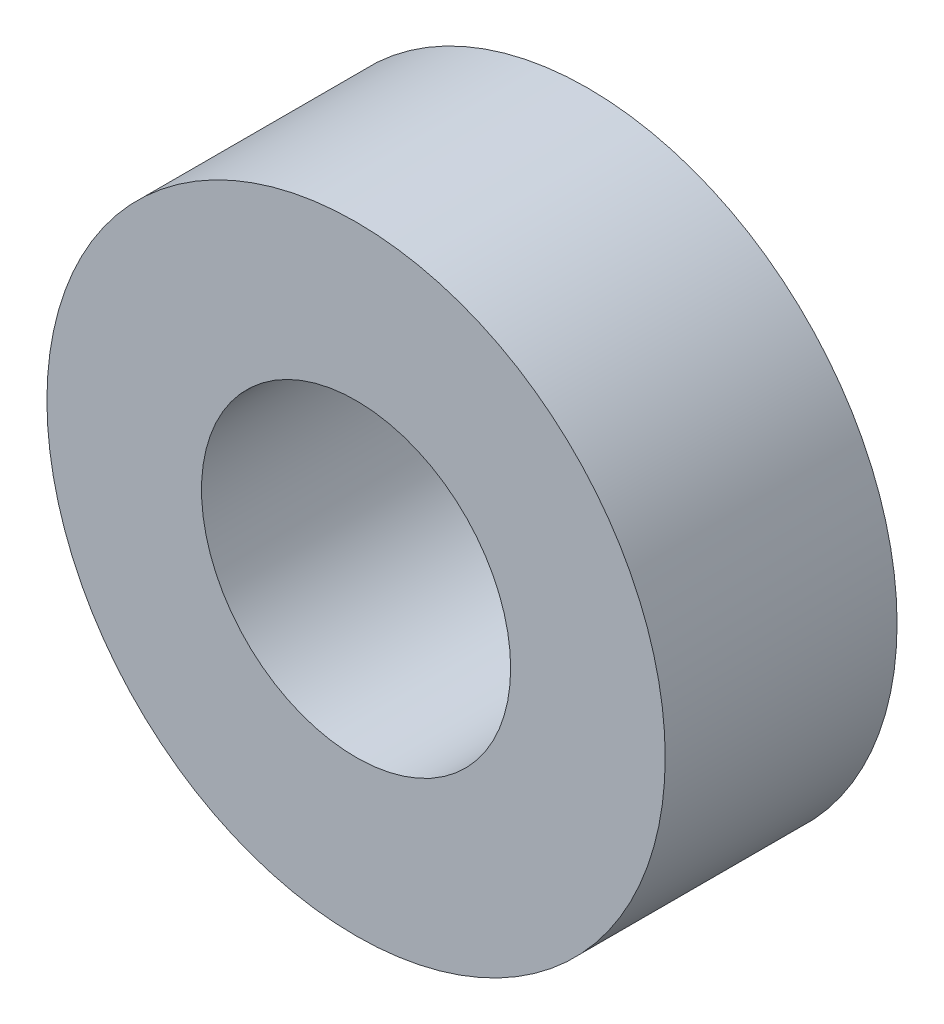
ISO-10303-21;
HEADER;
FILE_DESCRIPTION(('STEP AP214'),'2;1');
FILE_NAME('part.step','',(''),(''),'','','');
FILE_SCHEMA(('AUTOMOTIVE_DESIGN { 1 0 10303 214 1 1 1 1 }'));
ENDSEC;
DATA;
#1=APPLICATION_CONTEXT('core data for automotive mechanical design processes');
#2=APPLICATION_PROTOCOL_DEFINITION('international standard','automotive_design',2000,#1);
#3=PRODUCT_CONTEXT('',#1,'mechanical');
#4=PRODUCT('Part','Part','',(#3));
#5=PRODUCT_RELATED_PRODUCT_CATEGORY('part','',(#4));
#6=PRODUCT_DEFINITION_FORMATION('','',#4);
#7=PRODUCT_DEFINITION_CONTEXT('part definition',#1,'design');
#8=PRODUCT_DEFINITION('design','',#6,#7);
#9=PRODUCT_DEFINITION_SHAPE('','',#8);
#10=(LENGTH_UNIT() NAMED_UNIT(*) SI_UNIT(.MILLI.,.METRE.));
#11=(NAMED_UNIT(*) PLANE_ANGLE_UNIT() SI_UNIT($,.RADIAN.));
#12=(NAMED_UNIT(*) SI_UNIT($,.STERADIAN.) SOLID_ANGLE_UNIT());
#13=UNCERTAINTY_MEASURE_WITH_UNIT(LENGTH_MEASURE(1.E-05),#10,'distance_accuracy_value','');
#14=(GEOMETRIC_REPRESENTATION_CONTEXT(3) GLOBAL_UNCERTAINTY_ASSIGNED_CONTEXT((#13)) GLOBAL_UNIT_ASSIGNED_CONTEXT((#10,
#11,#12)) REPRESENTATION_CONTEXT('',''));
#15=CARTESIAN_POINT('',(0.,0.,0.));
#16=DIRECTION('',(0.,0.,1.));
#17=DIRECTION('',(1.,0.,0.));
#18=AXIS2_PLACEMENT_3D('',#15,#16,#17);
#19=CARTESIAN_POINT('',(290.308718482655,659.279772728152,9.52500000000056));
#20=DIRECTION('',(0.,0.,1.));
#21=DIRECTION('',(1.,0.,0.));
#22=AXIS2_PLACEMENT_3D('',#19,#20,#21);
#23=PLANE('',#22);
#24=CARTESIAN_POINT('',(290.308718482655,659.279772728152,9.52500000000056));
#25=DIRECTION('',(0.,0.,1.));
#26=DIRECTION('',(1.,0.,0.));
#27=AXIS2_PLACEMENT_3D('',#24,#25,#26);
#28=CIRCLE('',#27,6.34999999999999);
#29=CARTESIAN_POINT('',(296.658718482655,659.279772728152,9.52500000000056));
#30=VERTEX_POINT('',#29);
#31=EDGE_CURVE('E10',#30,#30,#28,.T.);
#32=ORIENTED_EDGE('',*,*,#31,.T.);
#33=EDGE_LOOP('',(#32));
#34=FACE_BOUND('',#33,.T.);
#35=CARTESIAN_POINT('',(290.308718482655,659.279772728152,9.52500000000056));
#36=DIRECTION('',(0.,0.,1.));
#37=DIRECTION('',(1.,0.,0.));
#38=AXIS2_PLACEMENT_3D('',#35,#36,#37);
#39=CIRCLE('',#38,3.17500000000002);
#40=CARTESIAN_POINT('',(293.483718482656,659.279772728152,9.52500000000056));
#41=VERTEX_POINT('',#40);
#42=EDGE_CURVE('E42',#41,#41,#39,.T.);
#43=ORIENTED_EDGE('',*,*,#42,.F.);
#44=EDGE_LOOP('',(#43));
#45=FACE_BOUND('',#44,.T.);
#46=ADVANCED_FACE('F31',(#34,#45),#23,.T.);
#47=CARTESIAN_POINT('',(290.308718482655,659.279772728152,4.76250000000056));
#48=DIRECTION('',(0.,0.,1.));
#49=DIRECTION('',(1.,0.,0.));
#50=AXIS2_PLACEMENT_3D('',#47,#48,#49);
#51=PLANE('',#50);
#52=CARTESIAN_POINT('',(290.308718482655,659.279772728152,4.76250000000056));
#53=DIRECTION('',(0.,0.,1.));
#54=DIRECTION('',(1.,0.,0.));
#55=AXIS2_PLACEMENT_3D('',#52,#53,#54);
#56=CIRCLE('',#55,6.34999999999999);
#57=CARTESIAN_POINT('',(296.658718482655,659.279772728152,4.76250000000056));
#58=VERTEX_POINT('',#57);
#59=EDGE_CURVE('E35',#58,#58,#56,.T.);
#60=ORIENTED_EDGE('',*,*,#59,.F.);
#61=EDGE_LOOP('',(#60));
#62=FACE_BOUND('',#61,.T.);
#63=CARTESIAN_POINT('',(290.308718482655,659.279772728152,4.76250000000056));
#64=DIRECTION('',(0.,0.,1.));
#65=DIRECTION('',(1.,0.,0.));
#66=AXIS2_PLACEMENT_3D('',#63,#64,#65);
#67=CIRCLE('',#66,3.17500000000002);
#68=CARTESIAN_POINT('',(293.483718482656,659.279772728152,4.76250000000056));
#69=VERTEX_POINT('',#68);
#70=EDGE_CURVE('E44',#69,#69,#67,.T.);
#71=ORIENTED_EDGE('',*,*,#70,.T.);
#72=EDGE_LOOP('',(#71));
#73=FACE_BOUND('',#72,.T.);
#74=ADVANCED_FACE('F54',(#62,#73),#51,.F.);
#75=CARTESIAN_POINT('',(290.308718482655,659.279772728152,9.52500000000056));
#76=DIRECTION('',(0.,0.,-1.));
#77=DIRECTION('',(-1.,0.,0.));
#78=AXIS2_PLACEMENT_3D('',#75,#76,#77);
#79=CYLINDRICAL_SURFACE('',#78,6.34999999999999);
#80=ORIENTED_EDGE('',*,*,#31,.F.);
#81=EDGE_LOOP('',(#80));
#82=FACE_BOUND('',#81,.T.);
#83=ORIENTED_EDGE('',*,*,#59,.T.);
#84=EDGE_LOOP('',(#83));
#85=FACE_BOUND('',#84,.T.);
#86=ADVANCED_FACE('F33',(#82,#85),#79,.T.);
#87=CARTESIAN_POINT('',(290.308718482655,659.279772728152,9.52500000000056));
#88=DIRECTION('',(0.,0.,-1.));
#89=DIRECTION('',(-1.,0.,0.));
#90=AXIS2_PLACEMENT_3D('',#87,#88,#89);
#91=CYLINDRICAL_SURFACE('',#90,3.17500000000002);
#92=ORIENTED_EDGE('',*,*,#42,.T.);
#93=EDGE_LOOP('',(#92));
#94=FACE_BOUND('',#93,.T.);
#95=ORIENTED_EDGE('',*,*,#70,.F.);
#96=EDGE_LOOP('',(#95));
#97=FACE_BOUND('',#96,.T.);
#98=ADVANCED_FACE('F50',(#94,#97),#91,.F.);
#99=CLOSED_SHELL('',(#46,#74,#86,#98));
#100=MANIFOLD_SOLID_BREP('B2',#99);
#101=ADVANCED_BREP_SHAPE_REPRESENTATION('',(#18,#100),#14);
#102=SHAPE_DEFINITION_REPRESENTATION(#9,#101);
ENDSEC;
END-ISO-10303-21;
